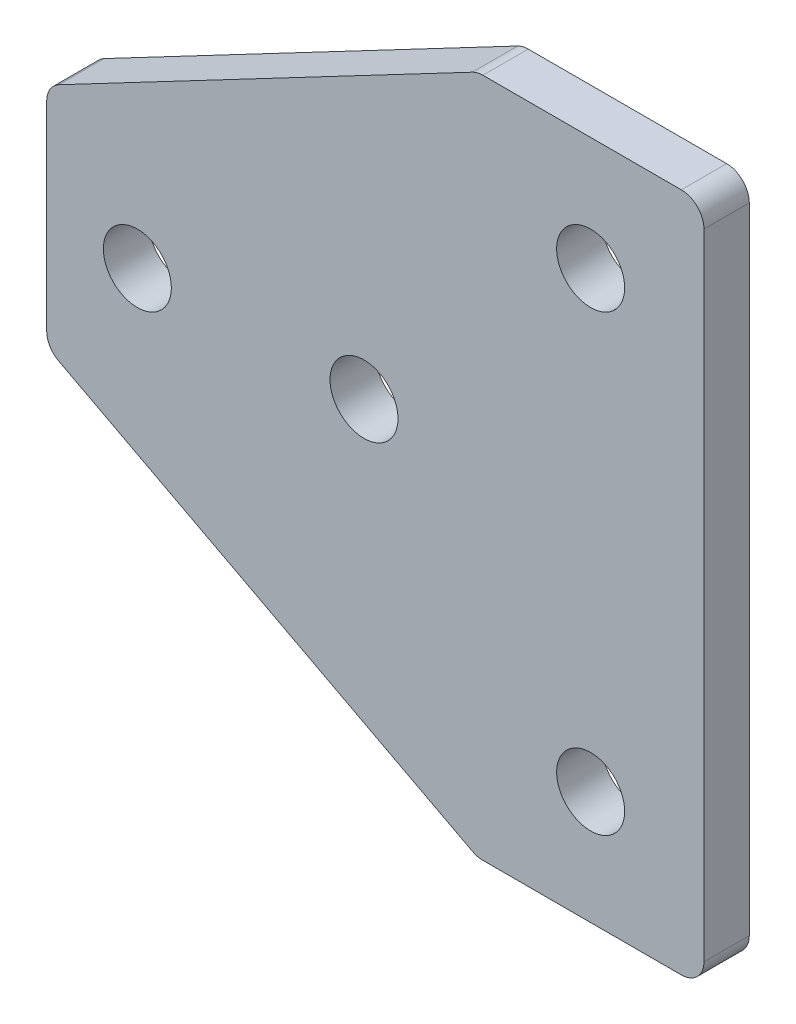
ISO-10303-21;
HEADER;
FILE_DESCRIPTION(('STEP AP214'),'2;1');
FILE_NAME('part.step','',(''),(''),'','','');
FILE_SCHEMA(('AUTOMOTIVE_DESIGN { 1 0 10303 214 1 1 1 1 }'));
ENDSEC;
DATA;
#1=APPLICATION_CONTEXT('core data for automotive mechanical design processes');
#2=APPLICATION_PROTOCOL_DEFINITION('international standard','automotive_design',2000,#1);
#3=PRODUCT_CONTEXT('',#1,'mechanical');
#4=PRODUCT('Part','Part','',(#3));
#5=PRODUCT_RELATED_PRODUCT_CATEGORY('part','',(#4));
#6=PRODUCT_DEFINITION_FORMATION('','',#4);
#7=PRODUCT_DEFINITION_CONTEXT('part definition',#1,'design');
#8=PRODUCT_DEFINITION('design','',#6,#7);
#9=PRODUCT_DEFINITION_SHAPE('','',#8);
#10=(LENGTH_UNIT() NAMED_UNIT(*) SI_UNIT(.MILLI.,.METRE.));
#11=(NAMED_UNIT(*) PLANE_ANGLE_UNIT() SI_UNIT($,.RADIAN.));
#12=(NAMED_UNIT(*) SI_UNIT($,.STERADIAN.) SOLID_ANGLE_UNIT());
#13=UNCERTAINTY_MEASURE_WITH_UNIT(LENGTH_MEASURE(1.E-05),#10,'distance_accuracy_value','');
#14=(GEOMETRIC_REPRESENTATION_CONTEXT(3) GLOBAL_UNCERTAINTY_ASSIGNED_CONTEXT((#13)) GLOBAL_UNIT_ASSIGNED_CONTEXT((#10,
#11,#12)) REPRESENTATION_CONTEXT('',''));
#15=CARTESIAN_POINT('',(0.,0.,0.));
#16=DIRECTION('',(0.,0.,1.));
#17=DIRECTION('',(1.,0.,0.));
#18=AXIS2_PLACEMENT_3D('',#15,#16,#17);
#19=CARTESIAN_POINT('',(0.,0.,2.));
#20=DIRECTION('',(0.,0.,-1.));
#21=DIRECTION('',(-1.,0.,0.));
#22=AXIS2_PLACEMENT_3D('',#19,#20,#21);
#23=PLANE('',#22);
#24=DIRECTION('',(1.,0.,0.));
#25=VECTOR('',#24,1.);
#26=CARTESIAN_POINT('',(0.,-15.,2.));
#27=LINE('',#26,#25);
#28=CARTESIAN_POINT('',(-9.75290894464162,-15.,2.));
#29=VERTEX_POINT('',#28);
#30=CARTESIAN_POINT('',(-1.,-15.,2.));
#31=VERTEX_POINT('',#30);
#32=EDGE_CURVE('E226',#29,#31,#27,.T.);
#33=ORIENTED_EDGE('',*,*,#32,.T.);
#34=CARTESIAN_POINT('',(-1.,-14.,2.));
#35=DIRECTION('',(0.,0.,-1.));
#36=DIRECTION('',(-1.,0.,0.));
#37=AXIS2_PLACEMENT_3D('',#34,#35,#36);
#38=CIRCLE('',#37,1.);
#39=CARTESIAN_POINT('',(0.,-14.,2.));
#40=VERTEX_POINT('',#39);
#41=EDGE_CURVE('E187',#31,#40,#38,.F.);
#42=ORIENTED_EDGE('',*,*,#41,.T.);
#43=DIRECTION('',(0.,1.,0.));
#44=VECTOR('',#43,1.);
#45=CARTESIAN_POINT('',(0.,15.,2.));
#46=LINE('',#45,#44);
#47=CARTESIAN_POINT('',(0.,14.,2.));
#48=VERTEX_POINT('',#47);
#49=EDGE_CURVE('E149',#40,#48,#46,.T.);
#50=ORIENTED_EDGE('',*,*,#49,.T.);
#51=CARTESIAN_POINT('',(-1.,14.,2.));
#52=DIRECTION('',(0.,0.,-1.));
#53=DIRECTION('',(-1.,0.,0.));
#54=AXIS2_PLACEMENT_3D('',#51,#52,#53);
#55=CIRCLE('',#54,1.);
#56=CARTESIAN_POINT('',(-1.,15.,2.));
#57=VERTEX_POINT('',#56);
#58=EDGE_CURVE('E183',#48,#57,#55,.F.);
#59=ORIENTED_EDGE('',*,*,#58,.T.);
#60=DIRECTION('',(-1.,0.,0.));
#61=VECTOR('',#60,1.);
#62=CARTESIAN_POINT('',(-10.,15.,2.));
#63=LINE('',#62,#61);
#64=CARTESIAN_POINT('',(-9.75290894464162,15.,2.));
#65=VERTEX_POINT('',#64);
#66=EDGE_CURVE('E157',#57,#65,#63,.T.);
#67=ORIENTED_EDGE('',*,*,#66,.T.);
#68=CARTESIAN_POINT('',(-9.75290894464162,14.,2.));
#69=DIRECTION('',(0.,0.,-1.));
#70=DIRECTION('',(-1.,0.,0.));
#71=AXIS2_PLACEMENT_3D('',#68,#69,#70);
#72=CIRCLE('',#71,1.);
#73=CARTESIAN_POINT('',(-10.2186553774742,14.884918222382,2.));
#74=VERTEX_POINT('',#73);
#75=EDGE_CURVE('E181',#65,#74,#72,.F.);
#76=ORIENTED_EDGE('',*,*,#75,.T.);
#77=DIRECTION('',(-0.884918222381982,-0.465746432832622,0.));
#78=VECTOR('',#77,1.);
#79=CARTESIAN_POINT('',(-29.,5.,2.));
#80=LINE('',#79,#78);
#81=CARTESIAN_POINT('',(-28.4657464328326,5.28118608798283,2.));
#82=VERTEX_POINT('',#81);
#83=EDGE_CURVE('E161',#74,#82,#80,.T.);
#84=ORIENTED_EDGE('',*,*,#83,.T.);
#85=CARTESIAN_POINT('',(-28.,4.39626786560084,2.));
#86=DIRECTION('',(0.,0.,-1.));
#87=DIRECTION('',(-1.,0.,0.));
#88=AXIS2_PLACEMENT_3D('',#85,#86,#87);
#89=CIRCLE('',#88,1.);
#90=CARTESIAN_POINT('',(-29.,4.39626786560084,2.));
#91=VERTEX_POINT('',#90);
#92=EDGE_CURVE('E178',#82,#91,#89,.F.);
#93=ORIENTED_EDGE('',*,*,#92,.T.);
#94=DIRECTION('',(0.,-1.,0.));
#95=VECTOR('',#94,1.);
#96=CARTESIAN_POINT('',(-29.,5.,2.));
#97=LINE('',#96,#95);
#98=CARTESIAN_POINT('',(-29.,-4.39626786560085,2.));
#99=VERTEX_POINT('',#98);
#100=EDGE_CURVE('E211',#91,#99,#97,.T.);
#101=ORIENTED_EDGE('',*,*,#100,.T.);
#102=CARTESIAN_POINT('',(-28.,-4.39626786560085,2.));
#103=DIRECTION('',(0.,0.,-1.));
#104=DIRECTION('',(-1.,0.,0.));
#105=AXIS2_PLACEMENT_3D('',#102,#103,#104);
#106=CIRCLE('',#105,1.);
#107=CARTESIAN_POINT('',(-28.4657464328326,-5.28118608798283,2.));
#108=VERTEX_POINT('',#107);
#109=EDGE_CURVE('E61',#99,#108,#106,.F.);
#110=ORIENTED_EDGE('',*,*,#109,.T.);
#111=DIRECTION('',(0.884918222381982,-0.465746432832622,0.));
#112=VECTOR('',#111,1.);
#113=CARTESIAN_POINT('',(-10.,-15.,2.));
#114=LINE('',#113,#112);
#115=CARTESIAN_POINT('',(-10.2186553774742,-14.884918222382,2.));
#116=VERTEX_POINT('',#115);
#117=EDGE_CURVE('E229',#108,#116,#114,.T.);
#118=ORIENTED_EDGE('',*,*,#117,.T.);
#119=CARTESIAN_POINT('',(-9.75290894464162,-14.,2.));
#120=DIRECTION('',(0.,0.,-1.));
#121=DIRECTION('',(-1.,0.,0.));
#122=AXIS2_PLACEMENT_3D('',#119,#120,#121);
#123=CIRCLE('',#122,1.);
#124=EDGE_CURVE('E185',#116,#29,#123,.F.);
#125=ORIENTED_EDGE('',*,*,#124,.T.);
#126=EDGE_LOOP('',(#33,#42,#50,#59,#67,#76,#84,#93,#101,#110,#118,#125));
#127=FACE_BOUND('',#126,.T.);
#128=CARTESIAN_POINT('',(-5.,10.,2.));
#129=DIRECTION('',(0.,0.,1.));
#130=DIRECTION('',(1.,0.,0.));
#131=AXIS2_PLACEMENT_3D('',#128,#129,#130);
#132=CIRCLE('',#131,1.5);
#133=CARTESIAN_POINT('',(-3.50000000000001,10.,2.));
#134=VERTEX_POINT('',#133);
#135=EDGE_CURVE('E224',#134,#134,#132,.T.);
#136=ORIENTED_EDGE('',*,*,#135,.F.);
#137=EDGE_LOOP('',(#136));
#138=FACE_BOUND('',#137,.T.);
#139=CARTESIAN_POINT('',(-15.,0.,2.));
#140=DIRECTION('',(0.,0.,1.));
#141=DIRECTION('',(1.,0.,0.));
#142=AXIS2_PLACEMENT_3D('',#139,#140,#141);
#143=CIRCLE('',#142,1.5);
#144=CARTESIAN_POINT('',(-13.5,0.,2.));
#145=VERTEX_POINT('',#144);
#146=EDGE_CURVE('E237',#145,#145,#143,.T.);
#147=ORIENTED_EDGE('',*,*,#146,.F.);
#148=EDGE_LOOP('',(#147));
#149=FACE_BOUND('',#148,.T.);
#150=CARTESIAN_POINT('',(-25.,0.,2.));
#151=DIRECTION('',(0.,0.,1.));
#152=DIRECTION('',(1.,0.,0.));
#153=AXIS2_PLACEMENT_3D('',#150,#151,#152);
#154=CIRCLE('',#153,1.5);
#155=CARTESIAN_POINT('',(-23.5,0.,2.));
#156=VERTEX_POINT('',#155);
#157=EDGE_CURVE('E243',#156,#156,#154,.T.);
#158=ORIENTED_EDGE('',*,*,#157,.F.);
#159=EDGE_LOOP('',(#158));
#160=FACE_BOUND('',#159,.T.);
#161=CARTESIAN_POINT('',(-5.,-10.,2.));
#162=DIRECTION('',(0.,0.,1.));
#163=DIRECTION('',(1.,0.,0.));
#164=AXIS2_PLACEMENT_3D('',#161,#162,#163);
#165=CIRCLE('',#164,1.5);
#166=CARTESIAN_POINT('',(-3.50000000000001,-10.,2.));
#167=VERTEX_POINT('',#166);
#168=EDGE_CURVE('E249',#167,#167,#165,.T.);
#169=ORIENTED_EDGE('',*,*,#168,.F.);
#170=EDGE_LOOP('',(#169));
#171=FACE_BOUND('',#170,.T.);
#172=ADVANCED_FACE('F39',(#127,#138,#149,#160,#171),#23,.F.);
#173=CARTESIAN_POINT('',(0.,0.,0.));
#174=DIRECTION('',(0.,0.,-1.));
#175=DIRECTION('',(-1.,0.,0.));
#176=AXIS2_PLACEMENT_3D('',#173,#174,#175);
#177=PLANE('',#176);
#178=CARTESIAN_POINT('',(-25.,0.,0.));
#179=DIRECTION('',(0.,0.,1.));
#180=DIRECTION('',(1.,0.,0.));
#181=AXIS2_PLACEMENT_3D('',#178,#179,#180);
#182=CIRCLE('',#181,1.5);
#183=CARTESIAN_POINT('',(-23.5,0.,0.));
#184=VERTEX_POINT('',#183);
#185=EDGE_CURVE('E246',#184,#184,#182,.T.);
#186=ORIENTED_EDGE('',*,*,#185,.T.);
#187=EDGE_LOOP('',(#186));
#188=FACE_BOUND('',#187,.T.);
#189=CARTESIAN_POINT('',(-5.,10.,0.));
#190=DIRECTION('',(0.,0.,1.));
#191=DIRECTION('',(1.,0.,0.));
#192=AXIS2_PLACEMENT_3D('',#189,#190,#191);
#193=CIRCLE('',#192,1.5);
#194=CARTESIAN_POINT('',(-3.50000000000001,10.,0.));
#195=VERTEX_POINT('',#194);
#196=EDGE_CURVE('E234',#195,#195,#193,.T.);
#197=ORIENTED_EDGE('',*,*,#196,.T.);
#198=EDGE_LOOP('',(#197));
#199=FACE_BOUND('',#198,.T.);
#200=DIRECTION('',(0.,1.,0.));
#201=VECTOR('',#200,1.);
#202=CARTESIAN_POINT('',(0.,15.,0.));
#203=LINE('',#202,#201);
#204=CARTESIAN_POINT('',(0.,-14.,0.));
#205=VERTEX_POINT('',#204);
#206=CARTESIAN_POINT('',(0.,14.,0.));
#207=VERTEX_POINT('',#206);
#208=EDGE_CURVE('E146',#205,#207,#203,.T.);
#209=ORIENTED_EDGE('',*,*,#208,.F.);
#210=CARTESIAN_POINT('',(-1.,-14.,0.));
#211=DIRECTION('',(0.,0.,-1.));
#212=DIRECTION('',(-1.,0.,0.));
#213=AXIS2_PLACEMENT_3D('',#210,#211,#212);
#214=CIRCLE('',#213,1.);
#215=CARTESIAN_POINT('',(-1.,-15.,0.));
#216=VERTEX_POINT('',#215);
#217=EDGE_CURVE('E129',#205,#216,#214,.T.);
#218=ORIENTED_EDGE('',*,*,#217,.T.);
#219=DIRECTION('',(1.,0.,0.));
#220=VECTOR('',#219,1.);
#221=CARTESIAN_POINT('',(0.,-15.,0.));
#222=LINE('',#221,#220);
#223=CARTESIAN_POINT('',(-9.75290894464162,-15.,0.));
#224=VERTEX_POINT('',#223);
#225=EDGE_CURVE('E158',#224,#216,#222,.T.);
#226=ORIENTED_EDGE('',*,*,#225,.F.);
#227=CARTESIAN_POINT('',(-9.75290894464162,-14.,0.));
#228=DIRECTION('',(0.,0.,-1.));
#229=DIRECTION('',(-1.,0.,0.));
#230=AXIS2_PLACEMENT_3D('',#227,#228,#229);
#231=CIRCLE('',#230,1.);
#232=CARTESIAN_POINT('',(-10.2186553774742,-14.884918222382,0.));
#233=VERTEX_POINT('',#232);
#234=EDGE_CURVE('E140',#224,#233,#231,.T.);
#235=ORIENTED_EDGE('',*,*,#234,.T.);
#236=DIRECTION('',(0.884918222381982,-0.465746432832622,0.));
#237=VECTOR('',#236,1.);
#238=CARTESIAN_POINT('',(-10.,-15.,0.));
#239=LINE('',#238,#237);
#240=CARTESIAN_POINT('',(-28.4657464328326,-5.28118608798283,0.));
#241=VERTEX_POINT('',#240);
#242=EDGE_CURVE('E163',#241,#233,#239,.T.);
#243=ORIENTED_EDGE('',*,*,#242,.F.);
#244=CARTESIAN_POINT('',(-28.,-4.39626786560085,0.));
#245=DIRECTION('',(0.,0.,-1.));
#246=DIRECTION('',(-1.,0.,0.));
#247=AXIS2_PLACEMENT_3D('',#244,#245,#246);
#248=CIRCLE('',#247,1.);
#249=CARTESIAN_POINT('',(-29.,-4.39626786560085,0.));
#250=VERTEX_POINT('',#249);
#251=EDGE_CURVE('E169',#241,#250,#248,.T.);
#252=ORIENTED_EDGE('',*,*,#251,.T.);
#253=DIRECTION('',(0.,-1.,0.));
#254=VECTOR('',#253,1.);
#255=CARTESIAN_POINT('',(-29.,5.,0.));
#256=LINE('',#255,#254);
#257=CARTESIAN_POINT('',(-29.,4.39626786560084,0.));
#258=VERTEX_POINT('',#257);
#259=EDGE_CURVE('E209',#258,#250,#256,.T.);
#260=ORIENTED_EDGE('',*,*,#259,.F.);
#261=CARTESIAN_POINT('',(-28.,4.39626786560084,0.));
#262=DIRECTION('',(0.,0.,-1.));
#263=DIRECTION('',(-1.,0.,0.));
#264=AXIS2_PLACEMENT_3D('',#261,#262,#263);
#265=CIRCLE('',#264,1.);
#266=CARTESIAN_POINT('',(-28.4657464328326,5.28118608798283,0.));
#267=VERTEX_POINT('',#266);
#268=EDGE_CURVE('E150',#258,#267,#265,.T.);
#269=ORIENTED_EDGE('',*,*,#268,.T.);
#270=DIRECTION('',(-0.884918222381982,-0.465746432832622,0.));
#271=VECTOR('',#270,1.);
#272=CARTESIAN_POINT('',(-29.,5.,0.));
#273=LINE('',#272,#271);
#274=CARTESIAN_POINT('',(-10.2186553774742,14.884918222382,0.));
#275=VERTEX_POINT('',#274);
#276=EDGE_CURVE('E217',#275,#267,#273,.T.);
#277=ORIENTED_EDGE('',*,*,#276,.F.);
#278=CARTESIAN_POINT('',(-9.75290894464162,14.,0.));
#279=DIRECTION('',(0.,0.,-1.));
#280=DIRECTION('',(-1.,0.,0.));
#281=AXIS2_PLACEMENT_3D('',#278,#279,#280);
#282=CIRCLE('',#281,1.);
#283=CARTESIAN_POINT('',(-9.75290894464162,15.,0.));
#284=VERTEX_POINT('',#283);
#285=EDGE_CURVE('E171',#275,#284,#282,.T.);
#286=ORIENTED_EDGE('',*,*,#285,.T.);
#287=DIRECTION('',(-1.,0.,0.));
#288=VECTOR('',#287,1.);
#289=CARTESIAN_POINT('',(-10.,15.,0.));
#290=LINE('',#289,#288);
#291=CARTESIAN_POINT('',(-1.,15.,0.));
#292=VERTEX_POINT('',#291);
#293=EDGE_CURVE('E219',#292,#284,#290,.T.);
#294=ORIENTED_EDGE('',*,*,#293,.F.);
#295=CARTESIAN_POINT('',(-1.,14.,0.));
#296=DIRECTION('',(0.,0.,-1.));
#297=DIRECTION('',(-1.,0.,0.));
#298=AXIS2_PLACEMENT_3D('',#295,#296,#297);
#299=CIRCLE('',#298,1.);
#300=EDGE_CURVE('E156',#292,#207,#299,.T.);
#301=ORIENTED_EDGE('',*,*,#300,.T.);
#302=EDGE_LOOP('',(#209,#218,#226,#235,#243,#252,#260,#269,#277,#286,#294,#301));
#303=FACE_BOUND('',#302,.T.);
#304=CARTESIAN_POINT('',(-15.,0.,0.));
#305=DIRECTION('',(0.,0.,1.));
#306=DIRECTION('',(1.,0.,0.));
#307=AXIS2_PLACEMENT_3D('',#304,#305,#306);
#308=CIRCLE('',#307,1.5);
#309=CARTESIAN_POINT('',(-13.5,0.,0.));
#310=VERTEX_POINT('',#309);
#311=EDGE_CURVE('E240',#310,#310,#308,.T.);
#312=ORIENTED_EDGE('',*,*,#311,.T.);
#313=EDGE_LOOP('',(#312));
#314=FACE_BOUND('',#313,.T.);
#315=CARTESIAN_POINT('',(-5.,-10.,0.));
#316=DIRECTION('',(0.,0.,1.));
#317=DIRECTION('',(1.,0.,0.));
#318=AXIS2_PLACEMENT_3D('',#315,#316,#317);
#319=CIRCLE('',#318,1.5);
#320=CARTESIAN_POINT('',(-3.50000000000001,-10.,0.));
#321=VERTEX_POINT('',#320);
#322=EDGE_CURVE('E252',#321,#321,#319,.T.);
#323=ORIENTED_EDGE('',*,*,#322,.T.);
#324=EDGE_LOOP('',(#323));
#325=FACE_BOUND('',#324,.T.);
#326=ADVANCED_FACE('F153',(#188,#199,#303,#314,#325),#177,.T.);
#327=CARTESIAN_POINT('',(-10.,15.,2.));
#328=DIRECTION('',(0.,-1.,0.));
#329=DIRECTION('',(1.,0.,0.));
#330=AXIS2_PLACEMENT_3D('',#327,#328,#329);
#331=PLANE('',#330);
#332=ORIENTED_EDGE('',*,*,#66,.F.);
#333=DIRECTION('',(0.,0.,-1.));
#334=VECTOR('',#333,1.);
#335=CARTESIAN_POINT('',(-1.,15.,2.));
#336=LINE('',#335,#334);
#337=EDGE_CURVE('E195',#57,#292,#336,.T.);
#338=ORIENTED_EDGE('',*,*,#337,.T.);
#339=ORIENTED_EDGE('',*,*,#293,.T.);
#340=DIRECTION('',(0.,0.,-1.));
#341=VECTOR('',#340,1.);
#342=CARTESIAN_POINT('',(-9.75290894464162,15.,2.));
#343=LINE('',#342,#341);
#344=EDGE_CURVE('E193',#284,#65,#343,.F.);
#345=ORIENTED_EDGE('',*,*,#344,.T.);
#346=EDGE_LOOP('',(#332,#338,#339,#345));
#347=FACE_BOUND('',#346,.T.);
#348=ADVANCED_FACE('F267',(#347),#331,.F.);
#349=CARTESIAN_POINT('',(-29.,5.,2.));
#350=DIRECTION('',(0.465746432832622,-0.884918222381982,0.));
#351=DIRECTION('',(0.884918222381982,0.465746432832622,0.));
#352=AXIS2_PLACEMENT_3D('',#349,#350,#351);
#353=PLANE('',#352);
#354=ORIENTED_EDGE('',*,*,#83,.F.);
#355=DIRECTION('',(0.,0.,-1.));
#356=VECTOR('',#355,1.);
#357=CARTESIAN_POINT('',(-10.2186553774742,14.884918222382,2.));
#358=LINE('',#357,#356);
#359=EDGE_CURVE('E200',#74,#275,#358,.T.);
#360=ORIENTED_EDGE('',*,*,#359,.T.);
#361=ORIENTED_EDGE('',*,*,#276,.T.);
#362=DIRECTION('',(0.,0.,-1.));
#363=VECTOR('',#362,1.);
#364=CARTESIAN_POINT('',(-28.4657464328326,5.28118608798283,2.));
#365=LINE('',#364,#363);
#366=EDGE_CURVE('E198',#267,#82,#365,.F.);
#367=ORIENTED_EDGE('',*,*,#366,.T.);
#368=EDGE_LOOP('',(#354,#360,#361,#367));
#369=FACE_BOUND('',#368,.T.);
#370=ADVANCED_FACE('F286',(#369),#353,.F.);
#371=CARTESIAN_POINT('',(-29.,5.,2.));
#372=DIRECTION('',(1.,0.,0.));
#373=DIRECTION('',(0.,0.,-1.));
#374=AXIS2_PLACEMENT_3D('',#371,#372,#373);
#375=PLANE('',#374);
#376=ORIENTED_EDGE('',*,*,#259,.T.);
#377=DIRECTION('',(0.,0.,-1.));
#378=VECTOR('',#377,1.);
#379=CARTESIAN_POINT('',(-29.,-4.39626786560085,2.));
#380=LINE('',#379,#378);
#381=EDGE_CURVE('E11',#250,#99,#380,.F.);
#382=ORIENTED_EDGE('',*,*,#381,.T.);
#383=ORIENTED_EDGE('',*,*,#100,.F.);
#384=DIRECTION('',(0.,0.,-1.));
#385=VECTOR('',#384,1.);
#386=CARTESIAN_POINT('',(-29.,4.39626786560084,2.));
#387=LINE('',#386,#385);
#388=EDGE_CURVE('E47',#91,#258,#387,.T.);
#389=ORIENTED_EDGE('',*,*,#388,.T.);
#390=EDGE_LOOP('',(#376,#382,#383,#389));
#391=FACE_BOUND('',#390,.T.);
#392=ADVANCED_FACE('F208',(#391),#375,.F.);
#393=CARTESIAN_POINT('',(-10.,-15.,2.));
#394=DIRECTION('',(0.465746432832622,0.884918222381982,0.));
#395=DIRECTION('',(-0.884918222381983,0.465746432832622,0.));
#396=AXIS2_PLACEMENT_3D('',#393,#394,#395);
#397=PLANE('',#396);
#398=ORIENTED_EDGE('',*,*,#242,.T.);
#399=DIRECTION('',(0.,0.,-1.));
#400=VECTOR('',#399,1.);
#401=CARTESIAN_POINT('',(-10.2186553774742,-14.884918222382,2.));
#402=LINE('',#401,#400);
#403=EDGE_CURVE('E54',#233,#116,#402,.F.);
#404=ORIENTED_EDGE('',*,*,#403,.T.);
#405=ORIENTED_EDGE('',*,*,#117,.F.);
#406=DIRECTION('',(0.,0.,-1.));
#407=VECTOR('',#406,1.);
#408=CARTESIAN_POINT('',(-28.4657464328326,-5.28118608798283,2.));
#409=LINE('',#408,#407);
#410=EDGE_CURVE('E189',#108,#241,#409,.T.);
#411=ORIENTED_EDGE('',*,*,#410,.T.);
#412=EDGE_LOOP('',(#398,#404,#405,#411));
#413=FACE_BOUND('',#412,.T.);
#414=ADVANCED_FACE('F280',(#413),#397,.F.);
#415=CARTESIAN_POINT('',(0.,-15.,2.));
#416=DIRECTION('',(0.,1.,0.));
#417=DIRECTION('',(-1.,0.,0.));
#418=AXIS2_PLACEMENT_3D('',#415,#416,#417);
#419=PLANE('',#418);
#420=ORIENTED_EDGE('',*,*,#225,.T.);
#421=DIRECTION('',(0.,0.,-1.));
#422=VECTOR('',#421,1.);
#423=CARTESIAN_POINT('',(-1.,-15.,2.));
#424=LINE('',#423,#422);
#425=EDGE_CURVE('E134',#216,#31,#424,.F.);
#426=ORIENTED_EDGE('',*,*,#425,.T.);
#427=ORIENTED_EDGE('',*,*,#32,.F.);
#428=DIRECTION('',(0.,0.,-1.));
#429=VECTOR('',#428,1.);
#430=CARTESIAN_POINT('',(-9.75290894464162,-15.,2.));
#431=LINE('',#430,#429);
#432=EDGE_CURVE('E139',#29,#224,#431,.T.);
#433=ORIENTED_EDGE('',*,*,#432,.T.);
#434=EDGE_LOOP('',(#420,#426,#427,#433));
#435=FACE_BOUND('',#434,.T.);
#436=ADVANCED_FACE('F277',(#435),#419,.F.);
#437=CARTESIAN_POINT('',(0.,15.,2.));
#438=DIRECTION('',(-1.,0.,0.));
#439=DIRECTION('',(0.,0.,1.));
#440=AXIS2_PLACEMENT_3D('',#437,#438,#439);
#441=PLANE('',#440);
#442=ORIENTED_EDGE('',*,*,#49,.F.);
#443=DIRECTION('',(0.,0.,-1.));
#444=VECTOR('',#443,1.);
#445=CARTESIAN_POINT('',(0.,-14.,2.));
#446=LINE('',#445,#444);
#447=EDGE_CURVE('E133',#40,#205,#446,.T.);
#448=ORIENTED_EDGE('',*,*,#447,.T.);
#449=ORIENTED_EDGE('',*,*,#208,.T.);
#450=DIRECTION('',(0.,0.,-1.));
#451=VECTOR('',#450,1.);
#452=CARTESIAN_POINT('',(0.,14.,2.));
#453=LINE('',#452,#451);
#454=EDGE_CURVE('E151',#207,#48,#453,.F.);
#455=ORIENTED_EDGE('',*,*,#454,.T.);
#456=EDGE_LOOP('',(#442,#448,#449,#455));
#457=FACE_BOUND('',#456,.T.);
#458=ADVANCED_FACE('F145',(#457),#441,.F.);
#459=CARTESIAN_POINT('',(-5.,10.,2.));
#460=DIRECTION('',(0.,0.,-1.));
#461=DIRECTION('',(-1.,0.,0.));
#462=AXIS2_PLACEMENT_3D('',#459,#460,#461);
#463=CYLINDRICAL_SURFACE('',#462,1.5);
#464=ORIENTED_EDGE('',*,*,#135,.T.);
#465=EDGE_LOOP('',(#464));
#466=FACE_BOUND('',#465,.T.);
#467=ORIENTED_EDGE('',*,*,#196,.F.);
#468=EDGE_LOOP('',(#467));
#469=FACE_BOUND('',#468,.T.);
#470=ADVANCED_FACE('F272',(#466,#469),#463,.F.);
#471=CARTESIAN_POINT('',(-15.,0.,2.));
#472=DIRECTION('',(0.,0.,-1.));
#473=DIRECTION('',(-1.,0.,0.));
#474=AXIS2_PLACEMENT_3D('',#471,#472,#473);
#475=CYLINDRICAL_SURFACE('',#474,1.5);
#476=ORIENTED_EDGE('',*,*,#146,.T.);
#477=EDGE_LOOP('',(#476));
#478=FACE_BOUND('',#477,.T.);
#479=ORIENTED_EDGE('',*,*,#311,.F.);
#480=EDGE_LOOP('',(#479));
#481=FACE_BOUND('',#480,.T.);
#482=ADVANCED_FACE('F433',(#478,#481),#475,.F.);
#483=CARTESIAN_POINT('',(-25.,0.,2.));
#484=DIRECTION('',(0.,0.,-1.));
#485=DIRECTION('',(-1.,0.,0.));
#486=AXIS2_PLACEMENT_3D('',#483,#484,#485);
#487=CYLINDRICAL_SURFACE('',#486,1.5);
#488=ORIENTED_EDGE('',*,*,#157,.T.);
#489=EDGE_LOOP('',(#488));
#490=FACE_BOUND('',#489,.T.);
#491=ORIENTED_EDGE('',*,*,#185,.F.);
#492=EDGE_LOOP('',(#491));
#493=FACE_BOUND('',#492,.T.);
#494=ADVANCED_FACE('F442',(#490,#493),#487,.F.);
#495=CARTESIAN_POINT('',(-5.,-10.,2.));
#496=DIRECTION('',(0.,0.,-1.));
#497=DIRECTION('',(-1.,0.,0.));
#498=AXIS2_PLACEMENT_3D('',#495,#496,#497);
#499=CYLINDRICAL_SURFACE('',#498,1.5);
#500=ORIENTED_EDGE('',*,*,#168,.T.);
#501=EDGE_LOOP('',(#500));
#502=FACE_BOUND('',#501,.T.);
#503=ORIENTED_EDGE('',*,*,#322,.F.);
#504=EDGE_LOOP('',(#503));
#505=FACE_BOUND('',#504,.T.);
#506=ADVANCED_FACE('F258',(#502,#505),#499,.F.);
#507=CARTESIAN_POINT('',(-1.,-14.,2.));
#508=DIRECTION('',(0.,0.,-1.));
#509=DIRECTION('',(-1.,0.,0.));
#510=AXIS2_PLACEMENT_3D('',#507,#508,#509);
#511=CYLINDRICAL_SURFACE('',#510,1.);
#512=ORIENTED_EDGE('',*,*,#41,.F.);
#513=ORIENTED_EDGE('',*,*,#425,.F.);
#514=ORIENTED_EDGE('',*,*,#217,.F.);
#515=ORIENTED_EDGE('',*,*,#447,.F.);
#516=EDGE_LOOP('',(#512,#513,#514,#515));
#517=FACE_BOUND('',#516,.T.);
#518=ADVANCED_FACE('F132',(#517),#511,.T.);
#519=CARTESIAN_POINT('',(-9.75290894464162,-14.,2.));
#520=DIRECTION('',(0.,0.,-1.));
#521=DIRECTION('',(-1.,0.,0.));
#522=AXIS2_PLACEMENT_3D('',#519,#520,#521);
#523=CYLINDRICAL_SURFACE('',#522,1.);
#524=ORIENTED_EDGE('',*,*,#124,.F.);
#525=ORIENTED_EDGE('',*,*,#403,.F.);
#526=ORIENTED_EDGE('',*,*,#234,.F.);
#527=ORIENTED_EDGE('',*,*,#432,.F.);
#528=EDGE_LOOP('',(#524,#525,#526,#527));
#529=FACE_BOUND('',#528,.T.);
#530=ADVANCED_FACE('F295',(#529),#523,.T.);
#531=CARTESIAN_POINT('',(-1.,14.,2.));
#532=DIRECTION('',(0.,0.,-1.));
#533=DIRECTION('',(-1.,0.,0.));
#534=AXIS2_PLACEMENT_3D('',#531,#532,#533);
#535=CYLINDRICAL_SURFACE('',#534,1.);
#536=ORIENTED_EDGE('',*,*,#58,.F.);
#537=ORIENTED_EDGE('',*,*,#454,.F.);
#538=ORIENTED_EDGE('',*,*,#300,.F.);
#539=ORIENTED_EDGE('',*,*,#337,.F.);
#540=EDGE_LOOP('',(#536,#537,#538,#539));
#541=FACE_BOUND('',#540,.T.);
#542=ADVANCED_FACE('F298',(#541),#535,.T.);
#543=CARTESIAN_POINT('',(-9.75290894464162,14.,2.));
#544=DIRECTION('',(0.,0.,-1.));
#545=DIRECTION('',(-1.,0.,0.));
#546=AXIS2_PLACEMENT_3D('',#543,#544,#545);
#547=CYLINDRICAL_SURFACE('',#546,1.);
#548=ORIENTED_EDGE('',*,*,#75,.F.);
#549=ORIENTED_EDGE('',*,*,#344,.F.);
#550=ORIENTED_EDGE('',*,*,#285,.F.);
#551=ORIENTED_EDGE('',*,*,#359,.F.);
#552=EDGE_LOOP('',(#548,#549,#550,#551));
#553=FACE_BOUND('',#552,.T.);
#554=ADVANCED_FACE('F302',(#553),#547,.T.);
#555=CARTESIAN_POINT('',(-28.,-4.39626786560085,2.));
#556=DIRECTION('',(0.,0.,-1.));
#557=DIRECTION('',(-1.,0.,0.));
#558=AXIS2_PLACEMENT_3D('',#555,#556,#557);
#559=CYLINDRICAL_SURFACE('',#558,1.);
#560=ORIENTED_EDGE('',*,*,#109,.F.);
#561=ORIENTED_EDGE('',*,*,#381,.F.);
#562=ORIENTED_EDGE('',*,*,#251,.F.);
#563=ORIENTED_EDGE('',*,*,#410,.F.);
#564=EDGE_LOOP('',(#560,#561,#562,#563));
#565=FACE_BOUND('',#564,.T.);
#566=ADVANCED_FACE('F305',(#565),#559,.T.);
#567=CARTESIAN_POINT('',(-28.,4.39626786560084,2.));
#568=DIRECTION('',(0.,0.,-1.));
#569=DIRECTION('',(-1.,0.,0.));
#570=AXIS2_PLACEMENT_3D('',#567,#568,#569);
#571=CYLINDRICAL_SURFACE('',#570,1.);
#572=ORIENTED_EDGE('',*,*,#92,.F.);
#573=ORIENTED_EDGE('',*,*,#366,.F.);
#574=ORIENTED_EDGE('',*,*,#268,.F.);
#575=ORIENTED_EDGE('',*,*,#388,.F.);
#576=EDGE_LOOP('',(#572,#573,#574,#575));
#577=FACE_BOUND('',#576,.T.);
#578=ADVANCED_FACE('F41',(#577),#571,.T.);
#579=CLOSED_SHELL('',(#172,#326,#348,#370,#392,#414,#436,#458,#470,#482,#494,#506,#518,#530,
#542,#554,#566,#578));
#580=MANIFOLD_SOLID_BREP('B2',#579);
#581=ADVANCED_BREP_SHAPE_REPRESENTATION('',(#18,#580),#14);
#582=SHAPE_DEFINITION_REPRESENTATION(#9,#581);
ENDSEC;
END-ISO-10303-21;
